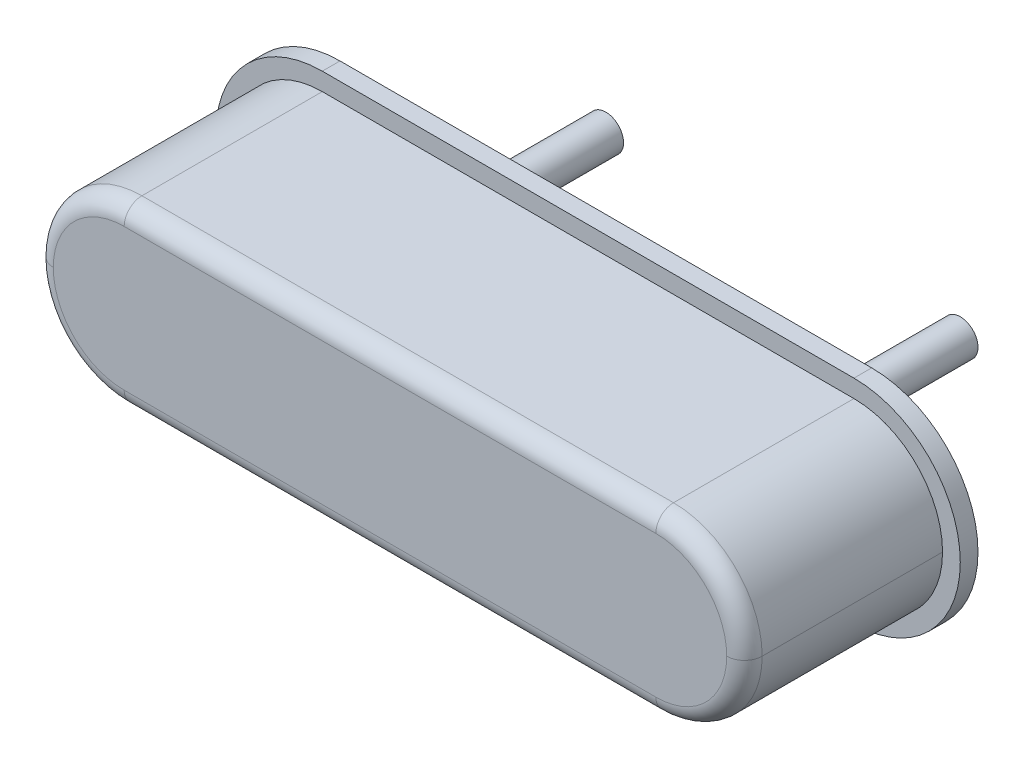
ISO-10303-21;
HEADER;
FILE_DESCRIPTION(('STEP AP214'),'2;1');
FILE_NAME('part.step','',(''),(''),'','','');
FILE_SCHEMA(('AUTOMOTIVE_DESIGN { 1 0 10303 214 1 1 1 1 }'));
ENDSEC;
DATA;
#1=APPLICATION_CONTEXT('core data for automotive mechanical design processes');
#2=APPLICATION_PROTOCOL_DEFINITION('international standard','automotive_design',2000,#1);
#3=PRODUCT_CONTEXT('',#1,'mechanical');
#4=PRODUCT('Part','Part','',(#3));
#5=PRODUCT_RELATED_PRODUCT_CATEGORY('part','',(#4));
#6=PRODUCT_DEFINITION_FORMATION('','',#4);
#7=PRODUCT_DEFINITION_CONTEXT('part definition',#1,'design');
#8=PRODUCT_DEFINITION('design','',#6,#7);
#9=PRODUCT_DEFINITION_SHAPE('','',#8);
#10=(LENGTH_UNIT() NAMED_UNIT(*) SI_UNIT(.MILLI.,.METRE.));
#11=(NAMED_UNIT(*) PLANE_ANGLE_UNIT() SI_UNIT($,.RADIAN.));
#12=(NAMED_UNIT(*) SI_UNIT($,.STERADIAN.) SOLID_ANGLE_UNIT());
#13=UNCERTAINTY_MEASURE_WITH_UNIT(LENGTH_MEASURE(1.E-05),#10,'distance_accuracy_value','');
#14=(GEOMETRIC_REPRESENTATION_CONTEXT(3) GLOBAL_UNCERTAINTY_ASSIGNED_CONTEXT((#13)) GLOBAL_UNIT_ASSIGNED_CONTEXT((#10,
#11,#12)) REPRESENTATION_CONTEXT('',''));
#15=CARTESIAN_POINT('',(0.,0.,0.));
#16=DIRECTION('',(0.,0.,1.));
#17=DIRECTION('',(1.,0.,0.));
#18=AXIS2_PLACEMENT_3D('',#15,#16,#17);
#19=CARTESIAN_POINT('',(-2.54,1.27,0.));
#20=DIRECTION('',(0.,1.,0.));
#21=DIRECTION('',(0.,0.,1.));
#22=AXIS2_PLACEMENT_3D('',#19,#20,#21);
#23=PLANE('',#22);
#24=DIRECTION('',(0.,0.,-1.));
#25=VECTOR('',#24,1.);
#26=CARTESIAN_POINT('',(6.35,1.27,0.));
#27=LINE('',#26,#25);
#28=CARTESIAN_POINT('',(6.35,1.27,2.83961477877701));
#29=VERTEX_POINT('',#28);
#30=CARTESIAN_POINT('',(6.35,1.27,0.254));
#31=VERTEX_POINT('',#30);
#32=EDGE_CURVE('E204',#29,#31,#27,.T.);
#33=ORIENTED_EDGE('',*,*,#32,.T.);
#34=DIRECTION('',(-1.,0.,0.));
#35=VECTOR('',#34,1.);
#36=CARTESIAN_POINT('',(-2.54,1.27,0.254));
#37=LINE('',#36,#35);
#38=CARTESIAN_POINT('',(-1.27,1.27,0.254));
#39=VERTEX_POINT('',#38);
#40=EDGE_CURVE('E176',#31,#39,#37,.T.);
#41=ORIENTED_EDGE('',*,*,#40,.T.);
#42=DIRECTION('',(0.,0.,1.));
#43=VECTOR('',#42,1.);
#44=CARTESIAN_POINT('',(-1.27,1.27,3.09361477877701));
#45=LINE('',#44,#43);
#46=CARTESIAN_POINT('',(-1.27,1.27,2.83961477877701));
#47=VERTEX_POINT('',#46);
#48=EDGE_CURVE('E207',#39,#47,#45,.T.);
#49=ORIENTED_EDGE('',*,*,#48,.T.);
#50=DIRECTION('',(-1.,0.,0.));
#51=VECTOR('',#50,1.);
#52=CARTESIAN_POINT('',(-2.54,1.27,2.83961477877701));
#53=LINE('',#52,#51);
#54=EDGE_CURVE('E226',#47,#29,#53,.F.);
#55=ORIENTED_EDGE('',*,*,#54,.T.);
#56=EDGE_LOOP('',(#33,#41,#49,#55));
#57=FACE_BOUND('',#56,.T.);
#58=ADVANCED_FACE('F35',(#57),#23,.T.);
#59=CARTESIAN_POINT('',(-2.54,-1.27,0.));
#60=DIRECTION('',(0.,1.,0.));
#61=DIRECTION('',(0.,0.,1.));
#62=AXIS2_PLACEMENT_3D('',#59,#60,#61);
#63=PLANE('',#62);
#64=DIRECTION('',(-1.,0.,0.));
#65=VECTOR('',#64,1.);
#66=CARTESIAN_POINT('',(-2.54,-1.27,0.254));
#67=LINE('',#66,#65);
#68=CARTESIAN_POINT('',(6.35,-1.27,0.254));
#69=VERTEX_POINT('',#68);
#70=CARTESIAN_POINT('',(-1.27,-1.27,0.254));
#71=VERTEX_POINT('',#70);
#72=EDGE_CURVE('E174',#69,#71,#67,.T.);
#73=ORIENTED_EDGE('',*,*,#72,.F.);
#74=DIRECTION('',(0.,0.,-1.));
#75=VECTOR('',#74,1.);
#76=CARTESIAN_POINT('',(6.35,-1.27,0.));
#77=LINE('',#76,#75);
#78=CARTESIAN_POINT('',(6.35,-1.27,2.83961477877701));
#79=VERTEX_POINT('',#78);
#80=EDGE_CURVE('E195',#69,#79,#77,.F.);
#81=ORIENTED_EDGE('',*,*,#80,.T.);
#82=DIRECTION('',(-1.,0.,0.));
#83=VECTOR('',#82,1.);
#84=CARTESIAN_POINT('',(-1.27,-1.27,2.83961477877701));
#85=LINE('',#84,#83);
#86=CARTESIAN_POINT('',(-1.27,-1.27,2.83961477877701));
#87=VERTEX_POINT('',#86);
#88=EDGE_CURVE('E235',#79,#87,#85,.T.);
#89=ORIENTED_EDGE('',*,*,#88,.T.);
#90=DIRECTION('',(0.,0.,1.));
#91=VECTOR('',#90,1.);
#92=CARTESIAN_POINT('',(-1.27,-1.27,0.));
#93=LINE('',#92,#91);
#94=EDGE_CURVE('E201',#87,#71,#93,.F.);
#95=ORIENTED_EDGE('',*,*,#94,.T.);
#96=EDGE_LOOP('',(#73,#81,#89,#95));
#97=FACE_BOUND('',#96,.T.);
#98=ADVANCED_FACE('F264',(#97),#63,.F.);
#99=CARTESIAN_POINT('',(-1.27,0.,0.));
#100=DIRECTION('',(0.,0.,-1.));
#101=DIRECTION('',(-1.,0.,0.));
#102=AXIS2_PLACEMENT_3D('',#99,#100,#101);
#103=CYLINDRICAL_SURFACE('',#102,1.27);
#104=ORIENTED_EDGE('',*,*,#48,.F.);
#105=CARTESIAN_POINT('',(-1.27,0.,0.254));
#106=DIRECTION('',(0.,0.,-1.));
#107=DIRECTION('',(-1.,0.,0.));
#108=AXIS2_PLACEMENT_3D('',#105,#106,#107);
#109=CIRCLE('',#108,1.27);
#110=CARTESIAN_POINT('',(-2.54,0.,0.254));
#111=VERTEX_POINT('',#110);
#112=EDGE_CURVE('E182',#39,#111,#109,.F.);
#113=ORIENTED_EDGE('',*,*,#112,.T.);
#114=DIRECTION('',(0.,0.,1.));
#115=VECTOR('',#114,1.);
#116=CARTESIAN_POINT('',(-2.54,0.,0.));
#117=LINE('',#116,#115);
#118=CARTESIAN_POINT('',(-2.54,0.,2.83961477877701));
#119=VERTEX_POINT('',#118);
#120=EDGE_CURVE('E199',#119,#111,#117,.F.);
#121=ORIENTED_EDGE('',*,*,#120,.F.);
#122=CARTESIAN_POINT('',(-1.27,0.,2.83961477877701));
#123=DIRECTION('',(0.,0.,1.));
#124=DIRECTION('',(1.,0.,0.));
#125=AXIS2_PLACEMENT_3D('',#122,#123,#124);
#126=CIRCLE('',#125,1.27);
#127=EDGE_CURVE('E43',#119,#47,#126,.F.);
#128=ORIENTED_EDGE('',*,*,#127,.T.);
#129=EDGE_LOOP('',(#104,#113,#121,#128));
#130=FACE_BOUND('',#129,.T.);
#131=ADVANCED_FACE('F269',(#130),#103,.T.);
#132=CARTESIAN_POINT('',(-1.27,0.,0.));
#133=DIRECTION('',(0.,0.,1.));
#134=DIRECTION('',(1.,0.,0.));
#135=AXIS2_PLACEMENT_3D('',#132,#133,#134);
#136=CYLINDRICAL_SURFACE('',#135,1.27);
#137=ORIENTED_EDGE('',*,*,#120,.T.);
#138=CARTESIAN_POINT('',(-1.27,0.,0.254));
#139=DIRECTION('',(0.,0.,-1.));
#140=DIRECTION('',(-1.,0.,0.));
#141=AXIS2_PLACEMENT_3D('',#138,#139,#140);
#142=CIRCLE('',#141,1.27);
#143=EDGE_CURVE('E179',#111,#71,#142,.F.);
#144=ORIENTED_EDGE('',*,*,#143,.T.);
#145=ORIENTED_EDGE('',*,*,#94,.F.);
#146=CARTESIAN_POINT('',(-1.27,0.,2.83961477877701));
#147=DIRECTION('',(0.,0.,1.));
#148=DIRECTION('',(1.,0.,0.));
#149=AXIS2_PLACEMENT_3D('',#146,#147,#148);
#150=CIRCLE('',#149,1.27);
#151=EDGE_CURVE('E57',#87,#119,#150,.F.);
#152=ORIENTED_EDGE('',*,*,#151,.T.);
#153=EDGE_LOOP('',(#137,#144,#145,#152));
#154=FACE_BOUND('',#153,.T.);
#155=ADVANCED_FACE('F266',(#154),#136,.T.);
#156=CARTESIAN_POINT('',(6.35,0.,0.));
#157=DIRECTION('',(0.,0.,1.));
#158=DIRECTION('',(1.,0.,0.));
#159=AXIS2_PLACEMENT_3D('',#156,#157,#158);
#160=CYLINDRICAL_SURFACE('',#159,1.27);
#161=DIRECTION('',(0.,0.,-1.));
#162=VECTOR('',#161,1.);
#163=CARTESIAN_POINT('',(7.62,0.,3.09361477877701));
#164=LINE('',#163,#162);
#165=CARTESIAN_POINT('',(7.62,0.,0.254));
#166=VERTEX_POINT('',#165);
#167=CARTESIAN_POINT('',(7.62,0.,2.83961477877701));
#168=VERTEX_POINT('',#167);
#169=EDGE_CURVE('E211',#166,#168,#164,.F.);
#170=ORIENTED_EDGE('',*,*,#169,.F.);
#171=CARTESIAN_POINT('',(6.35,0.,0.254));
#172=DIRECTION('',(0.,0.,-1.));
#173=DIRECTION('',(-1.,0.,0.));
#174=AXIS2_PLACEMENT_3D('',#171,#172,#173);
#175=CIRCLE('',#174,1.27);
#176=EDGE_CURVE('E50',#166,#31,#175,.F.);
#177=ORIENTED_EDGE('',*,*,#176,.T.);
#178=ORIENTED_EDGE('',*,*,#32,.F.);
#179=CARTESIAN_POINT('',(6.35,0.,2.83961477877701));
#180=DIRECTION('',(0.,0.,1.));
#181=DIRECTION('',(1.,0.,0.));
#182=AXIS2_PLACEMENT_3D('',#179,#180,#181);
#183=CIRCLE('',#182,1.27);
#184=EDGE_CURVE('E229',#29,#168,#183,.F.);
#185=ORIENTED_EDGE('',*,*,#184,.T.);
#186=EDGE_LOOP('',(#170,#177,#178,#185));
#187=FACE_BOUND('',#186,.T.);
#188=ADVANCED_FACE('F277',(#187),#160,.T.);
#189=CARTESIAN_POINT('',(6.35,0.,3.09361477877701));
#190=DIRECTION('',(0.,0.,-1.));
#191=DIRECTION('',(-1.,0.,0.));
#192=AXIS2_PLACEMENT_3D('',#189,#190,#191);
#193=CYLINDRICAL_SURFACE('',#192,1.27);
#194=ORIENTED_EDGE('',*,*,#80,.F.);
#195=CARTESIAN_POINT('',(6.35,0.,0.254));
#196=DIRECTION('',(0.,0.,-1.));
#197=DIRECTION('',(-1.,0.,0.));
#198=AXIS2_PLACEMENT_3D('',#195,#196,#197);
#199=CIRCLE('',#198,1.27);
#200=EDGE_CURVE('E11',#69,#166,#199,.F.);
#201=ORIENTED_EDGE('',*,*,#200,.T.);
#202=ORIENTED_EDGE('',*,*,#169,.T.);
#203=CARTESIAN_POINT('',(6.35,0.,2.83961477877701));
#204=DIRECTION('',(0.,0.,1.));
#205=DIRECTION('',(1.,0.,0.));
#206=AXIS2_PLACEMENT_3D('',#203,#204,#205);
#207=CIRCLE('',#206,1.27);
#208=EDGE_CURVE('E232',#168,#79,#207,.F.);
#209=ORIENTED_EDGE('',*,*,#208,.T.);
#210=EDGE_LOOP('',(#194,#201,#202,#209));
#211=FACE_BOUND('',#210,.T.);
#212=ADVANCED_FACE('F280',(#211),#193,.T.);
#213=CARTESIAN_POINT('',(7.62,1.27,3.09361477877701));
#214=DIRECTION('',(0.,0.,1.));
#215=DIRECTION('',(1.,0.,0.));
#216=AXIS2_PLACEMENT_3D('',#213,#214,#215);
#217=PLANE('',#216);
#218=CARTESIAN_POINT('',(6.35,0.,3.09361477877701));
#219=DIRECTION('',(0.,0.,1.));
#220=DIRECTION('',(1.,0.,0.));
#221=AXIS2_PLACEMENT_3D('',#218,#219,#220);
#222=CIRCLE('',#221,1.016);
#223=CARTESIAN_POINT('',(7.366,0.,3.09361477877701));
#224=VERTEX_POINT('',#223);
#225=CARTESIAN_POINT('',(6.35,1.016,3.09361477877701));
#226=VERTEX_POINT('',#225);
#227=EDGE_CURVE('E221',#224,#226,#222,.T.);
#228=ORIENTED_EDGE('',*,*,#227,.T.);
#229=DIRECTION('',(-1.,0.,0.));
#230=VECTOR('',#229,1.);
#231=CARTESIAN_POINT('',(7.62,1.016,3.09361477877701));
#232=LINE('',#231,#230);
#233=CARTESIAN_POINT('',(-1.27,1.016,3.09361477877701));
#234=VERTEX_POINT('',#233);
#235=EDGE_CURVE('E223',#226,#234,#232,.T.);
#236=ORIENTED_EDGE('',*,*,#235,.T.);
#237=CARTESIAN_POINT('',(-1.27,0.,3.09361477877701));
#238=DIRECTION('',(0.,0.,1.));
#239=DIRECTION('',(1.,0.,0.));
#240=AXIS2_PLACEMENT_3D('',#237,#238,#239);
#241=CIRCLE('',#240,1.016);
#242=CARTESIAN_POINT('',(-2.286,0.,3.09361477877701));
#243=VERTEX_POINT('',#242);
#244=EDGE_CURVE('E209',#234,#243,#241,.T.);
#245=ORIENTED_EDGE('',*,*,#244,.T.);
#246=CARTESIAN_POINT('',(-1.27,0.,3.09361477877701));
#247=DIRECTION('',(0.,0.,1.));
#248=DIRECTION('',(1.,0.,0.));
#249=AXIS2_PLACEMENT_3D('',#246,#247,#248);
#250=CIRCLE('',#249,1.016);
#251=CARTESIAN_POINT('',(-1.27,-1.016,3.09361477877701));
#252=VERTEX_POINT('',#251);
#253=EDGE_CURVE('E215',#243,#252,#250,.T.);
#254=ORIENTED_EDGE('',*,*,#253,.T.);
#255=DIRECTION('',(-1.,0.,0.));
#256=VECTOR('',#255,1.);
#257=CARTESIAN_POINT('',(6.35,-1.016,3.09361477877701));
#258=LINE('',#257,#256);
#259=CARTESIAN_POINT('',(6.35,-1.016,3.09361477877701));
#260=VERTEX_POINT('',#259);
#261=EDGE_CURVE('E217',#252,#260,#258,.F.);
#262=ORIENTED_EDGE('',*,*,#261,.T.);
#263=CARTESIAN_POINT('',(6.35,0.,3.09361477877701));
#264=DIRECTION('',(0.,0.,1.));
#265=DIRECTION('',(1.,0.,0.));
#266=AXIS2_PLACEMENT_3D('',#263,#264,#265);
#267=CIRCLE('',#266,1.016);
#268=EDGE_CURVE('E219',#260,#224,#267,.T.);
#269=ORIENTED_EDGE('',*,*,#268,.T.);
#270=EDGE_LOOP('',(#228,#236,#245,#254,#262,#269));
#271=FACE_BOUND('',#270,.T.);
#272=ADVANCED_FACE('F282',(#271),#217,.T.);
#273=CARTESIAN_POINT('',(-2.54,-1.016,2.83961477877701));
#274=DIRECTION('',(1.,0.,0.));
#275=DIRECTION('',(0.,0.,-1.));
#276=AXIS2_PLACEMENT_3D('',#273,#274,#275);
#277=CYLINDRICAL_SURFACE('',#276,0.254);
#278=CARTESIAN_POINT('',(-1.27,-1.016,2.83961477877701));
#279=DIRECTION('',(-1.,0.,0.));
#280=DIRECTION('',(0.,0.,1.));
#281=AXIS2_PLACEMENT_3D('',#278,#279,#280);
#282=CIRCLE('',#281,0.254);
#283=EDGE_CURVE('E249',#87,#252,#282,.T.);
#284=ORIENTED_EDGE('',*,*,#283,.F.);
#285=ORIENTED_EDGE('',*,*,#88,.F.);
#286=CARTESIAN_POINT('',(6.35,-1.016,2.83961477877701));
#287=DIRECTION('',(1.,0.,0.));
#288=DIRECTION('',(0.,0.,-1.));
#289=AXIS2_PLACEMENT_3D('',#286,#287,#288);
#290=CIRCLE('',#289,0.254);
#291=EDGE_CURVE('E213',#260,#79,#290,.T.);
#292=ORIENTED_EDGE('',*,*,#291,.F.);
#293=ORIENTED_EDGE('',*,*,#261,.F.);
#294=EDGE_LOOP('',(#284,#285,#292,#293));
#295=FACE_BOUND('',#294,.T.);
#296=ADVANCED_FACE('F37',(#295),#277,.T.);
#297=CARTESIAN_POINT('',(6.35,0.,2.83961477877701));
#298=DIRECTION('',(0.,0.,1.));
#299=DIRECTION('',(1.,0.,0.));
#300=AXIS2_PLACEMENT_3D('',#297,#298,#299);
#301=TOROIDAL_SURFACE('',#300,1.016,0.254);
#302=ORIENTED_EDGE('',*,*,#291,.T.);
#303=ORIENTED_EDGE('',*,*,#208,.F.);
#304=CARTESIAN_POINT('',(7.366,0.,2.83961477877701));
#305=DIRECTION('',(0.,1.,0.));
#306=DIRECTION('',(0.,0.,1.));
#307=AXIS2_PLACEMENT_3D('',#304,#305,#306);
#308=CIRCLE('',#307,0.254);
#309=EDGE_CURVE('E246',#224,#168,#308,.T.);
#310=ORIENTED_EDGE('',*,*,#309,.F.);
#311=ORIENTED_EDGE('',*,*,#268,.F.);
#312=EDGE_LOOP('',(#302,#303,#310,#311));
#313=FACE_BOUND('',#312,.T.);
#314=ADVANCED_FACE('F256',(#313),#301,.T.);
#315=CARTESIAN_POINT('',(-1.27,0.,2.83961477877701));
#316=DIRECTION('',(0.,0.,1.));
#317=DIRECTION('',(1.,0.,0.));
#318=AXIS2_PLACEMENT_3D('',#315,#316,#317);
#319=TOROIDAL_SURFACE('',#318,1.016,0.254);
#320=ORIENTED_EDGE('',*,*,#283,.T.);
#321=ORIENTED_EDGE('',*,*,#253,.F.);
#322=CARTESIAN_POINT('',(-2.286,0.,2.83961477877701));
#323=DIRECTION('',(0.,1.,0.));
#324=DIRECTION('',(0.,0.,1.));
#325=AXIS2_PLACEMENT_3D('',#322,#323,#324);
#326=CIRCLE('',#325,0.254);
#327=EDGE_CURVE('E243',#119,#243,#326,.T.);
#328=ORIENTED_EDGE('',*,*,#327,.F.);
#329=ORIENTED_EDGE('',*,*,#151,.F.);
#330=EDGE_LOOP('',(#320,#321,#328,#329));
#331=FACE_BOUND('',#330,.T.);
#332=ADVANCED_FACE('F414',(#331),#319,.T.);
#333=CARTESIAN_POINT('',(6.35,0.,2.83961477877701));
#334=DIRECTION('',(0.,0.,1.));
#335=DIRECTION('',(1.,0.,0.));
#336=AXIS2_PLACEMENT_3D('',#333,#334,#335);
#337=TOROIDAL_SURFACE('',#336,1.016,0.254);
#338=ORIENTED_EDGE('',*,*,#309,.T.);
#339=ORIENTED_EDGE('',*,*,#184,.F.);
#340=CARTESIAN_POINT('',(6.35,1.016,2.83961477877701));
#341=DIRECTION('',(-1.,0.,0.));
#342=DIRECTION('',(0.,0.,1.));
#343=AXIS2_PLACEMENT_3D('',#340,#341,#342);
#344=CIRCLE('',#343,0.254);
#345=EDGE_CURVE('E241',#226,#29,#344,.T.);
#346=ORIENTED_EDGE('',*,*,#345,.F.);
#347=ORIENTED_EDGE('',*,*,#227,.F.);
#348=EDGE_LOOP('',(#338,#339,#346,#347));
#349=FACE_BOUND('',#348,.T.);
#350=ADVANCED_FACE('F405',(#349),#337,.T.);
#351=CARTESIAN_POINT('',(-1.27,0.,2.83961477877701));
#352=DIRECTION('',(0.,0.,1.));
#353=DIRECTION('',(1.,0.,0.));
#354=AXIS2_PLACEMENT_3D('',#351,#352,#353);
#355=TOROIDAL_SURFACE('',#354,1.016,0.254);
#356=ORIENTED_EDGE('',*,*,#327,.T.);
#357=ORIENTED_EDGE('',*,*,#244,.F.);
#358=CARTESIAN_POINT('',(-1.27,1.016,2.83961477877701));
#359=DIRECTION('',(1.,0.,0.));
#360=DIRECTION('',(0.,0.,-1.));
#361=AXIS2_PLACEMENT_3D('',#358,#359,#360);
#362=CIRCLE('',#361,0.254);
#363=EDGE_CURVE('E191',#47,#234,#362,.T.);
#364=ORIENTED_EDGE('',*,*,#363,.F.);
#365=ORIENTED_EDGE('',*,*,#127,.F.);
#366=EDGE_LOOP('',(#356,#357,#364,#365));
#367=FACE_BOUND('',#366,.T.);
#368=ADVANCED_FACE('F400',(#367),#355,.T.);
#369=CARTESIAN_POINT('',(7.62,1.016,2.83961477877701));
#370=DIRECTION('',(-1.,0.,0.));
#371=DIRECTION('',(0.,0.,1.));
#372=AXIS2_PLACEMENT_3D('',#369,#370,#371);
#373=CYLINDRICAL_SURFACE('',#372,0.254);
#374=ORIENTED_EDGE('',*,*,#345,.T.);
#375=ORIENTED_EDGE('',*,*,#54,.F.);
#376=ORIENTED_EDGE('',*,*,#363,.T.);
#377=ORIENTED_EDGE('',*,*,#235,.F.);
#378=EDGE_LOOP('',(#374,#375,#376,#377));
#379=FACE_BOUND('',#378,.T.);
#380=ADVANCED_FACE('F350',(#379),#373,.T.);
#381=CARTESIAN_POINT('',(6.35,0.,0.254));
#382=DIRECTION('',(0.,0.,-1.));
#383=DIRECTION('',(-1.,0.,0.));
#384=AXIS2_PLACEMENT_3D('',#381,#382,#383);
#385=CYLINDRICAL_SURFACE('',#384,1.524);
#386=CARTESIAN_POINT('',(6.35,0.,0.));
#387=DIRECTION('',(0.,0.,-1.));
#388=DIRECTION('',(-1.,0.,0.));
#389=AXIS2_PLACEMENT_3D('',#386,#387,#388);
#390=CIRCLE('',#389,1.524);
#391=CARTESIAN_POINT('',(6.35,1.524,0.));
#392=VERTEX_POINT('',#391);
#393=CARTESIAN_POINT('',(6.35,-1.524,0.));
#394=VERTEX_POINT('',#393);
#395=EDGE_CURVE('E156',#392,#394,#390,.T.);
#396=ORIENTED_EDGE('',*,*,#395,.F.);
#397=DIRECTION('',(0.,0.,-1.));
#398=VECTOR('',#397,1.);
#399=CARTESIAN_POINT('',(6.35,1.524,0.254));
#400=LINE('',#399,#398);
#401=CARTESIAN_POINT('',(6.35,1.524,0.254));
#402=VERTEX_POINT('',#401);
#403=EDGE_CURVE('E154',#402,#392,#400,.T.);
#404=ORIENTED_EDGE('',*,*,#403,.F.);
#405=CARTESIAN_POINT('',(6.35,0.,0.254));
#406=DIRECTION('',(0.,0.,-1.));
#407=DIRECTION('',(-1.,0.,0.));
#408=AXIS2_PLACEMENT_3D('',#405,#406,#407);
#409=CIRCLE('',#408,1.524);
#410=CARTESIAN_POINT('',(6.35,-1.524,0.254));
#411=VERTEX_POINT('',#410);
#412=EDGE_CURVE('E149',#402,#411,#409,.T.);
#413=ORIENTED_EDGE('',*,*,#412,.T.);
#414=DIRECTION('',(0.,0.,-1.));
#415=VECTOR('',#414,1.);
#416=CARTESIAN_POINT('',(6.35,-1.524,0.254));
#417=LINE('',#416,#415);
#418=EDGE_CURVE('E132',#411,#394,#417,.T.);
#419=ORIENTED_EDGE('',*,*,#418,.T.);
#420=EDGE_LOOP('',(#396,#404,#413,#419));
#421=FACE_BOUND('',#420,.T.);
#422=ADVANCED_FACE('F153',(#421),#385,.T.);
#423=CARTESIAN_POINT('',(-1.27,1.524,0.254));
#424=DIRECTION('',(0.,1.,0.));
#425=DIRECTION('',(0.,0.,1.));
#426=AXIS2_PLACEMENT_3D('',#423,#424,#425);
#427=PLANE('',#426);
#428=DIRECTION('',(1.,0.,0.));
#429=VECTOR('',#428,1.);
#430=CARTESIAN_POINT('',(-1.27,1.524,0.));
#431=LINE('',#430,#429);
#432=CARTESIAN_POINT('',(-1.27,1.524,0.));
#433=VERTEX_POINT('',#432);
#434=EDGE_CURVE('E158',#433,#392,#431,.T.);
#435=ORIENTED_EDGE('',*,*,#434,.F.);
#436=DIRECTION('',(0.,0.,-1.));
#437=VECTOR('',#436,1.);
#438=CARTESIAN_POINT('',(-1.27,1.524,0.254));
#439=LINE('',#438,#437);
#440=CARTESIAN_POINT('',(-1.27,1.524,0.254));
#441=VERTEX_POINT('',#440);
#442=EDGE_CURVE('E170',#441,#433,#439,.T.);
#443=ORIENTED_EDGE('',*,*,#442,.F.);
#444=DIRECTION('',(1.,0.,0.));
#445=VECTOR('',#444,1.);
#446=CARTESIAN_POINT('',(-1.27,1.524,0.254));
#447=LINE('',#446,#445);
#448=EDGE_CURVE('E143',#441,#402,#447,.T.);
#449=ORIENTED_EDGE('',*,*,#448,.T.);
#450=ORIENTED_EDGE('',*,*,#403,.T.);
#451=EDGE_LOOP('',(#435,#443,#449,#450));
#452=FACE_BOUND('',#451,.T.);
#453=ADVANCED_FACE('F349',(#452),#427,.T.);
#454=CARTESIAN_POINT('',(-1.27,0.,0.254));
#455=DIRECTION('',(0.,0.,-1.));
#456=DIRECTION('',(-1.,0.,0.));
#457=AXIS2_PLACEMENT_3D('',#454,#455,#456);
#458=CYLINDRICAL_SURFACE('',#457,1.524);
#459=CARTESIAN_POINT('',(-1.27,0.,0.));
#460=DIRECTION('',(0.,0.,-1.));
#461=DIRECTION('',(-1.,0.,0.));
#462=AXIS2_PLACEMENT_3D('',#459,#460,#461);
#463=CIRCLE('',#462,1.524);
#464=CARTESIAN_POINT('',(-1.27,-1.524,0.));
#465=VERTEX_POINT('',#464);
#466=EDGE_CURVE('E164',#465,#433,#463,.T.);
#467=ORIENTED_EDGE('',*,*,#466,.F.);
#468=DIRECTION('',(0.,0.,-1.));
#469=VECTOR('',#468,1.);
#470=CARTESIAN_POINT('',(-1.27,-1.524,0.254));
#471=LINE('',#470,#469);
#472=CARTESIAN_POINT('',(-1.27,-1.524,0.254));
#473=VERTEX_POINT('',#472);
#474=EDGE_CURVE('E142',#473,#465,#471,.T.);
#475=ORIENTED_EDGE('',*,*,#474,.F.);
#476=CARTESIAN_POINT('',(-1.27,0.,0.254));
#477=DIRECTION('',(0.,0.,-1.));
#478=DIRECTION('',(-1.,0.,0.));
#479=AXIS2_PLACEMENT_3D('',#476,#477,#478);
#480=CIRCLE('',#479,1.524);
#481=EDGE_CURVE('E151',#473,#441,#480,.T.);
#482=ORIENTED_EDGE('',*,*,#481,.T.);
#483=ORIENTED_EDGE('',*,*,#442,.T.);
#484=EDGE_LOOP('',(#467,#475,#482,#483));
#485=FACE_BOUND('',#484,.T.);
#486=ADVANCED_FACE('F360',(#485),#458,.T.);
#487=CARTESIAN_POINT('',(6.35,-1.524,0.254));
#488=DIRECTION('',(0.,-1.,0.));
#489=DIRECTION('',(0.,0.,-1.));
#490=AXIS2_PLACEMENT_3D('',#487,#488,#489);
#491=PLANE('',#490);
#492=DIRECTION('',(-1.,0.,0.));
#493=VECTOR('',#492,1.);
#494=CARTESIAN_POINT('',(6.35,-1.524,0.));
#495=LINE('',#494,#493);
#496=EDGE_CURVE('E138',#394,#465,#495,.T.);
#497=ORIENTED_EDGE('',*,*,#496,.F.);
#498=ORIENTED_EDGE('',*,*,#418,.F.);
#499=DIRECTION('',(-1.,0.,0.));
#500=VECTOR('',#499,1.);
#501=CARTESIAN_POINT('',(6.35,-1.524,0.254));
#502=LINE('',#501,#500);
#503=EDGE_CURVE('E136',#411,#473,#502,.T.);
#504=ORIENTED_EDGE('',*,*,#503,.T.);
#505=ORIENTED_EDGE('',*,*,#474,.T.);
#506=EDGE_LOOP('',(#497,#498,#504,#505));
#507=FACE_BOUND('',#506,.T.);
#508=ADVANCED_FACE('F134',(#507),#491,.T.);
#509=CARTESIAN_POINT('',(6.35,0.,0.254));
#510=DIRECTION('',(0.,0.,-1.));
#511=DIRECTION('',(-1.,0.,0.));
#512=AXIS2_PLACEMENT_3D('',#509,#510,#511);
#513=PLANE('',#512);
#514=ORIENTED_EDGE('',*,*,#112,.F.);
#515=ORIENTED_EDGE('',*,*,#40,.F.);
#516=ORIENTED_EDGE('',*,*,#176,.F.);
#517=ORIENTED_EDGE('',*,*,#200,.F.);
#518=ORIENTED_EDGE('',*,*,#72,.T.);
#519=ORIENTED_EDGE('',*,*,#143,.F.);
#520=EDGE_LOOP('',(#514,#515,#516,#517,#518,#519));
#521=FACE_BOUND('',#520,.T.);
#522=ORIENTED_EDGE('',*,*,#412,.F.);
#523=ORIENTED_EDGE('',*,*,#448,.F.);
#524=ORIENTED_EDGE('',*,*,#481,.F.);
#525=ORIENTED_EDGE('',*,*,#503,.F.);
#526=EDGE_LOOP('',(#522,#523,#524,#525));
#527=FACE_BOUND('',#526,.T.);
#528=ADVANCED_FACE('F147',(#521,#527),#513,.F.);
#529=CARTESIAN_POINT('',(5.08,0.,-2.54));
#530=DIRECTION('',(0.,0.,1.));
#531=DIRECTION('',(-1.,0.,0.));
#532=AXIS2_PLACEMENT_3D('',#529,#530,#531);
#533=PLANE('',#532);
#534=CARTESIAN_POINT('',(5.08,0.,-2.54));
#535=DIRECTION('',(0.,0.,-1.));
#536=DIRECTION('',(-1.,0.,0.));
#537=AXIS2_PLACEMENT_3D('',#534,#535,#536);
#538=CIRCLE('',#537,0.254);
#539=CARTESIAN_POINT('',(4.826,0.,-2.54));
#540=VERTEX_POINT('',#539);
#541=EDGE_CURVE('E188',#540,#540,#538,.T.);
#542=ORIENTED_EDGE('',*,*,#541,.T.);
#543=EDGE_LOOP('',(#542));
#544=FACE_BOUND('',#543,.T.);
#545=ADVANCED_FACE('F310',(#544),#533,.F.);
#546=CARTESIAN_POINT('',(0.,0.,-2.54));
#547=DIRECTION('',(0.,0.,1.));
#548=DIRECTION('',(1.,0.,0.));
#549=AXIS2_PLACEMENT_3D('',#546,#547,#548);
#550=PLANE('',#549);
#551=CARTESIAN_POINT('',(0.,0.,-2.54));
#552=DIRECTION('',(0.,0.,1.));
#553=DIRECTION('',(1.,0.,0.));
#554=AXIS2_PLACEMENT_3D('',#551,#552,#553);
#555=CIRCLE('',#554,0.254);
#556=CARTESIAN_POINT('',(0.254,0.,-2.54));
#557=VERTEX_POINT('',#556);
#558=EDGE_CURVE('E192',#557,#557,#555,.T.);
#559=ORIENTED_EDGE('',*,*,#558,.F.);
#560=EDGE_LOOP('',(#559));
#561=FACE_BOUND('',#560,.T.);
#562=ADVANCED_FACE('F307',(#561),#550,.F.);
#563=CARTESIAN_POINT('',(5.08,0.,0.508));
#564=DIRECTION('',(0.,0.,-1.));
#565=DIRECTION('',(1.,0.,0.));
#566=AXIS2_PLACEMENT_3D('',#563,#564,#565);
#567=CYLINDRICAL_SURFACE('',#566,0.254);
#568=CARTESIAN_POINT('',(5.08,0.,0.));
#569=DIRECTION('',(0.,0.,1.));
#570=DIRECTION('',(1.,0.,0.));
#571=AXIS2_PLACEMENT_3D('',#568,#569,#570);
#572=CIRCLE('',#571,0.254);
#573=CARTESIAN_POINT('',(5.334,0.,0.));
#574=VERTEX_POINT('',#573);
#575=EDGE_CURVE('E185',#574,#574,#572,.T.);
#576=ORIENTED_EDGE('',*,*,#575,.F.);
#577=EDGE_LOOP('',(#576));
#578=FACE_BOUND('',#577,.T.);
#579=ORIENTED_EDGE('',*,*,#541,.F.);
#580=EDGE_LOOP('',(#579));
#581=FACE_BOUND('',#580,.T.);
#582=ADVANCED_FACE('F299',(#578,#581),#567,.T.);
#583=CARTESIAN_POINT('',(0.,0.,0.508));
#584=DIRECTION('',(0.,0.,-1.));
#585=DIRECTION('',(-1.,0.,0.));
#586=AXIS2_PLACEMENT_3D('',#583,#584,#585);
#587=CYLINDRICAL_SURFACE('',#586,0.254);
#588=CARTESIAN_POINT('',(0.,0.,0.));
#589=DIRECTION('',(0.,0.,-1.));
#590=DIRECTION('',(-1.,0.,0.));
#591=AXIS2_PLACEMENT_3D('',#588,#589,#590);
#592=CIRCLE('',#591,0.254);
#593=CARTESIAN_POINT('',(-0.254,0.,0.));
#594=VERTEX_POINT('',#593);
#595=EDGE_CURVE('E196',#594,#594,#592,.T.);
#596=ORIENTED_EDGE('',*,*,#595,.T.);
#597=EDGE_LOOP('',(#596));
#598=FACE_BOUND('',#597,.T.);
#599=ORIENTED_EDGE('',*,*,#558,.T.);
#600=EDGE_LOOP('',(#599));
#601=FACE_BOUND('',#600,.T.);
#602=ADVANCED_FACE('F304',(#598,#601),#587,.T.);
#603=CARTESIAN_POINT('',(-2.54,1.27,0.));
#604=DIRECTION('',(0.,0.,-1.));
#605=DIRECTION('',(-1.,0.,0.));
#606=AXIS2_PLACEMENT_3D('',#603,#604,#605);
#607=PLANE('',#606);
#608=ORIENTED_EDGE('',*,*,#595,.F.);
#609=EDGE_LOOP('',(#608));
#610=FACE_BOUND('',#609,.T.);
#611=ORIENTED_EDGE('',*,*,#575,.T.);
#612=EDGE_LOOP('',(#611));
#613=FACE_BOUND('',#612,.T.);
#614=ORIENTED_EDGE('',*,*,#395,.T.);
#615=ORIENTED_EDGE('',*,*,#496,.T.);
#616=ORIENTED_EDGE('',*,*,#466,.T.);
#617=ORIENTED_EDGE('',*,*,#434,.T.);
#618=EDGE_LOOP('',(#614,#615,#616,#617));
#619=FACE_BOUND('',#618,.T.);
#620=ADVANCED_FACE('F302',(#610,#613,#619),#607,.T.);
#621=CLOSED_SHELL('',(#58,#98,#131,#155,#188,#212,#272,#296,#314,#332,#350,#368,#380,#422,#453,
#486,#508,#528,#545,#562,#582,#602,#620));
#622=MANIFOLD_SOLID_BREP('B2',#621);
#623=ADVANCED_BREP_SHAPE_REPRESENTATION('',(#18,#622),#14);
#624=SHAPE_DEFINITION_REPRESENTATION(#9,#623);
ENDSEC;
END-ISO-10303-21;
